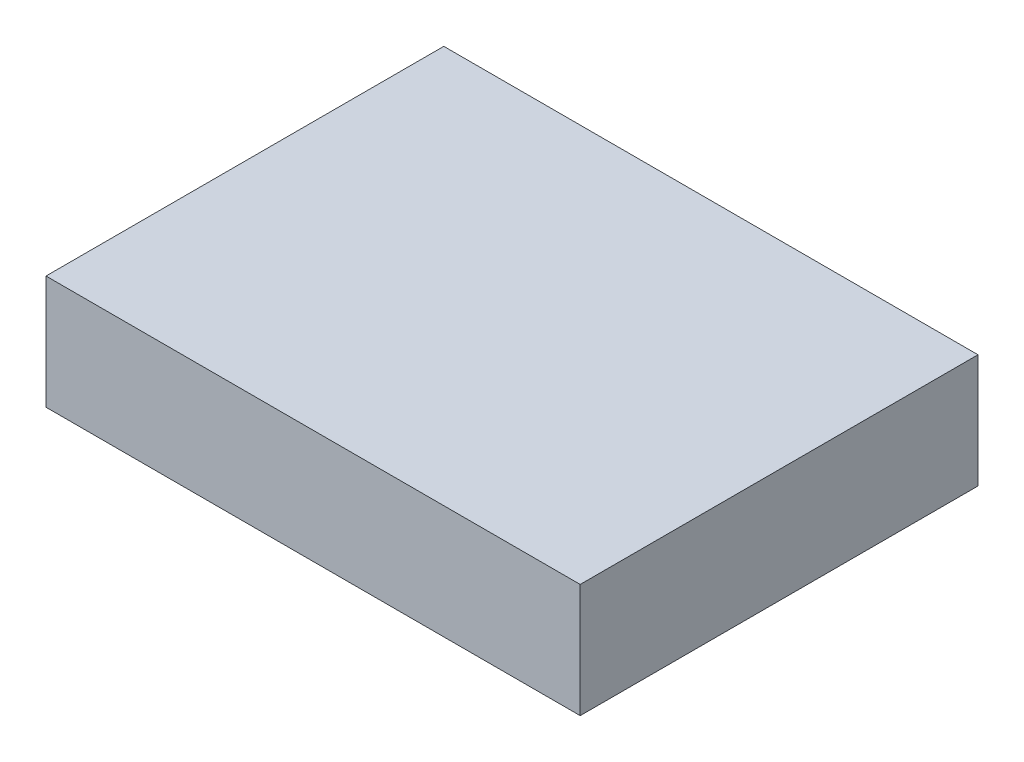
ISO-10303-21;
HEADER;
FILE_DESCRIPTION(('STEP AP214'),'2;1');
FILE_NAME('part.step','',(''),(''),'','','');
FILE_SCHEMA(('AUTOMOTIVE_DESIGN { 1 0 10303 214 1 1 1 1 }'));
ENDSEC;
DATA;
#1=APPLICATION_CONTEXT('core data for automotive mechanical design processes');
#2=APPLICATION_PROTOCOL_DEFINITION('international standard','automotive_design',2000,#1);
#3=PRODUCT_CONTEXT('',#1,'mechanical');
#4=PRODUCT('Part','Part','',(#3));
#5=PRODUCT_RELATED_PRODUCT_CATEGORY('part','',(#4));
#6=PRODUCT_DEFINITION_FORMATION('','',#4);
#7=PRODUCT_DEFINITION_CONTEXT('part definition',#1,'design');
#8=PRODUCT_DEFINITION('design','',#6,#7);
#9=PRODUCT_DEFINITION_SHAPE('','',#8);
#10=(LENGTH_UNIT() NAMED_UNIT(*) SI_UNIT(.MILLI.,.METRE.));
#11=(NAMED_UNIT(*) PLANE_ANGLE_UNIT() SI_UNIT($,.RADIAN.));
#12=(NAMED_UNIT(*) SI_UNIT($,.STERADIAN.) SOLID_ANGLE_UNIT());
#13=UNCERTAINTY_MEASURE_WITH_UNIT(LENGTH_MEASURE(1.E-05),#10,'distance_accuracy_value','');
#14=(GEOMETRIC_REPRESENTATION_CONTEXT(3) GLOBAL_UNCERTAINTY_ASSIGNED_CONTEXT((#13)) GLOBAL_UNIT_ASSIGNED_CONTEXT((#10,
#11,#12)) REPRESENTATION_CONTEXT('',''));
#15=CARTESIAN_POINT('',(0.,0.,0.));
#16=DIRECTION('',(0.,0.,1.));
#17=DIRECTION('',(1.,0.,0.));
#18=AXIS2_PLACEMENT_3D('',#15,#16,#17);
#19=CARTESIAN_POINT('',(-23.5,10.,-17.5));
#20=DIRECTION('',(1.,0.,0.));
#21=DIRECTION('',(0.,0.,-1.));
#22=AXIS2_PLACEMENT_3D('',#19,#20,#21);
#23=PLANE('',#22);
#24=DIRECTION('',(0.,0.,1.));
#25=VECTOR('',#24,1.);
#26=CARTESIAN_POINT('',(-23.5,0.,-17.5));
#27=LINE('',#26,#25);
#28=CARTESIAN_POINT('',(-23.5,0.,-17.5));
#29=VERTEX_POINT('',#28);
#30=CARTESIAN_POINT('',(-23.5,0.,17.5));
#31=VERTEX_POINT('',#30);
#32=EDGE_CURVE('E96',#29,#31,#27,.T.);
#33=ORIENTED_EDGE('',*,*,#32,.T.);
#34=DIRECTION('',(0.,-1.,0.));
#35=VECTOR('',#34,1.);
#36=CARTESIAN_POINT('',(-23.5,10.,17.5));
#37=LINE('',#36,#35);
#38=CARTESIAN_POINT('',(-23.5,10.,17.5));
#39=VERTEX_POINT('',#38);
#40=EDGE_CURVE('E11',#39,#31,#37,.T.);
#41=ORIENTED_EDGE('',*,*,#40,.F.);
#42=DIRECTION('',(0.,0.,1.));
#43=VECTOR('',#42,1.);
#44=CARTESIAN_POINT('',(-23.5,10.,-17.5));
#45=LINE('',#44,#43);
#46=CARTESIAN_POINT('',(-23.5,10.,-17.5));
#47=VERTEX_POINT('',#46);
#48=EDGE_CURVE('E84',#47,#39,#45,.T.);
#49=ORIENTED_EDGE('',*,*,#48,.F.);
#50=DIRECTION('',(0.,-1.,0.));
#51=VECTOR('',#50,1.);
#52=CARTESIAN_POINT('',(-23.5,10.,-17.5));
#53=LINE('',#52,#51);
#54=EDGE_CURVE('E92',#47,#29,#53,.T.);
#55=ORIENTED_EDGE('',*,*,#54,.T.);
#56=EDGE_LOOP('',(#33,#41,#49,#55));
#57=FACE_BOUND('',#56,.T.);
#58=ADVANCED_FACE('F33',(#57),#23,.F.);
#59=CARTESIAN_POINT('',(-23.5,10.,17.5));
#60=DIRECTION('',(0.,0.,-1.));
#61=DIRECTION('',(-1.,0.,0.));
#62=AXIS2_PLACEMENT_3D('',#59,#60,#61);
#63=PLANE('',#62);
#64=DIRECTION('',(1.,0.,0.));
#65=VECTOR('',#64,1.);
#66=CARTESIAN_POINT('',(-23.5,0.,17.5));
#67=LINE('',#66,#65);
#68=CARTESIAN_POINT('',(23.5,0.,17.5));
#69=VERTEX_POINT('',#68);
#70=EDGE_CURVE('E88',#31,#69,#67,.T.);
#71=ORIENTED_EDGE('',*,*,#70,.T.);
#72=DIRECTION('',(0.,-1.,0.));
#73=VECTOR('',#72,1.);
#74=CARTESIAN_POINT('',(23.5,10.,17.5));
#75=LINE('',#74,#73);
#76=CARTESIAN_POINT('',(23.5,10.,17.5));
#77=VERTEX_POINT('',#76);
#78=EDGE_CURVE('E41',#77,#69,#75,.T.);
#79=ORIENTED_EDGE('',*,*,#78,.F.);
#80=DIRECTION('',(1.,0.,0.));
#81=VECTOR('',#80,1.);
#82=CARTESIAN_POINT('',(-23.5,10.,17.5));
#83=LINE('',#82,#81);
#84=EDGE_CURVE('E79',#39,#77,#83,.T.);
#85=ORIENTED_EDGE('',*,*,#84,.F.);
#86=ORIENTED_EDGE('',*,*,#40,.T.);
#87=EDGE_LOOP('',(#71,#79,#85,#86));
#88=FACE_BOUND('',#87,.T.);
#89=ADVANCED_FACE('F87',(#88),#63,.F.);
#90=CARTESIAN_POINT('',(23.5,10.,-17.5));
#91=DIRECTION('',(-1.,0.,0.));
#92=DIRECTION('',(0.,0.,1.));
#93=AXIS2_PLACEMENT_3D('',#90,#91,#92);
#94=PLANE('',#93);
#95=DIRECTION('',(0.,0.,-1.));
#96=VECTOR('',#95,1.);
#97=CARTESIAN_POINT('',(23.5,0.,-17.5));
#98=LINE('',#97,#96);
#99=CARTESIAN_POINT('',(23.5,0.,-17.5));
#100=VERTEX_POINT('',#99);
#101=EDGE_CURVE('E66',#69,#100,#98,.T.);
#102=ORIENTED_EDGE('',*,*,#101,.T.);
#103=DIRECTION('',(0.,-1.,0.));
#104=VECTOR('',#103,1.);
#105=CARTESIAN_POINT('',(23.5,10.,-17.5));
#106=LINE('',#105,#104);
#107=CARTESIAN_POINT('',(23.5,10.,-17.5));
#108=VERTEX_POINT('',#107);
#109=EDGE_CURVE('E89',#108,#100,#106,.T.);
#110=ORIENTED_EDGE('',*,*,#109,.F.);
#111=DIRECTION('',(0.,0.,-1.));
#112=VECTOR('',#111,1.);
#113=CARTESIAN_POINT('',(23.5,10.,-17.5));
#114=LINE('',#113,#112);
#115=EDGE_CURVE('E82',#77,#108,#114,.T.);
#116=ORIENTED_EDGE('',*,*,#115,.F.);
#117=ORIENTED_EDGE('',*,*,#78,.T.);
#118=EDGE_LOOP('',(#102,#110,#116,#117));
#119=FACE_BOUND('',#118,.T.);
#120=ADVANCED_FACE('F90',(#119),#94,.F.);
#121=CARTESIAN_POINT('',(-23.5,10.,-17.5));
#122=DIRECTION('',(0.,0.,1.));
#123=DIRECTION('',(1.,0.,0.));
#124=AXIS2_PLACEMENT_3D('',#121,#122,#123);
#125=PLANE('',#124);
#126=DIRECTION('',(-1.,0.,0.));
#127=VECTOR('',#126,1.);
#128=CARTESIAN_POINT('',(-23.5,0.,-17.5));
#129=LINE('',#128,#127);
#130=EDGE_CURVE('E72',#100,#29,#129,.T.);
#131=ORIENTED_EDGE('',*,*,#130,.T.);
#132=ORIENTED_EDGE('',*,*,#54,.F.);
#133=DIRECTION('',(-1.,0.,0.));
#134=VECTOR('',#133,1.);
#135=CARTESIAN_POINT('',(-23.5,10.,-17.5));
#136=LINE('',#135,#134);
#137=EDGE_CURVE('E49',#108,#47,#136,.T.);
#138=ORIENTED_EDGE('',*,*,#137,.F.);
#139=ORIENTED_EDGE('',*,*,#109,.T.);
#140=EDGE_LOOP('',(#131,#132,#138,#139));
#141=FACE_BOUND('',#140,.T.);
#142=ADVANCED_FACE('F103',(#141),#125,.F.);
#143=CARTESIAN_POINT('',(0.,10.,0.));
#144=DIRECTION('',(0.,1.,0.));
#145=DIRECTION('',(0.,0.,1.));
#146=AXIS2_PLACEMENT_3D('',#143,#144,#145);
#147=PLANE('',#146);
#148=ORIENTED_EDGE('',*,*,#48,.T.);
#149=ORIENTED_EDGE('',*,*,#84,.T.);
#150=ORIENTED_EDGE('',*,*,#115,.T.);
#151=ORIENTED_EDGE('',*,*,#137,.T.);
#152=EDGE_LOOP('',(#148,#149,#150,#151));
#153=FACE_BOUND('',#152,.T.);
#154=ADVANCED_FACE('F80',(#153),#147,.T.);
#155=CARTESIAN_POINT('',(0.,0.,0.));
#156=DIRECTION('',(0.,1.,0.));
#157=DIRECTION('',(0.,0.,1.));
#158=AXIS2_PLACEMENT_3D('',#155,#156,#157);
#159=PLANE('',#158);
#160=ORIENTED_EDGE('',*,*,#32,.F.);
#161=ORIENTED_EDGE('',*,*,#130,.F.);
#162=ORIENTED_EDGE('',*,*,#101,.F.);
#163=ORIENTED_EDGE('',*,*,#70,.F.);
#164=EDGE_LOOP('',(#160,#161,#162,#163));
#165=FACE_BOUND('',#164,.T.);
#166=ADVANCED_FACE('F106',(#165),#159,.F.);
#167=CLOSED_SHELL('',(#58,#89,#120,#142,#154,#166));
#168=MANIFOLD_SOLID_BREP('B2',#167);
#169=ADVANCED_BREP_SHAPE_REPRESENTATION('',(#18,#168),#14);
#170=SHAPE_DEFINITION_REPRESENTATION(#9,#169);
ENDSEC;
END-ISO-10303-21;
